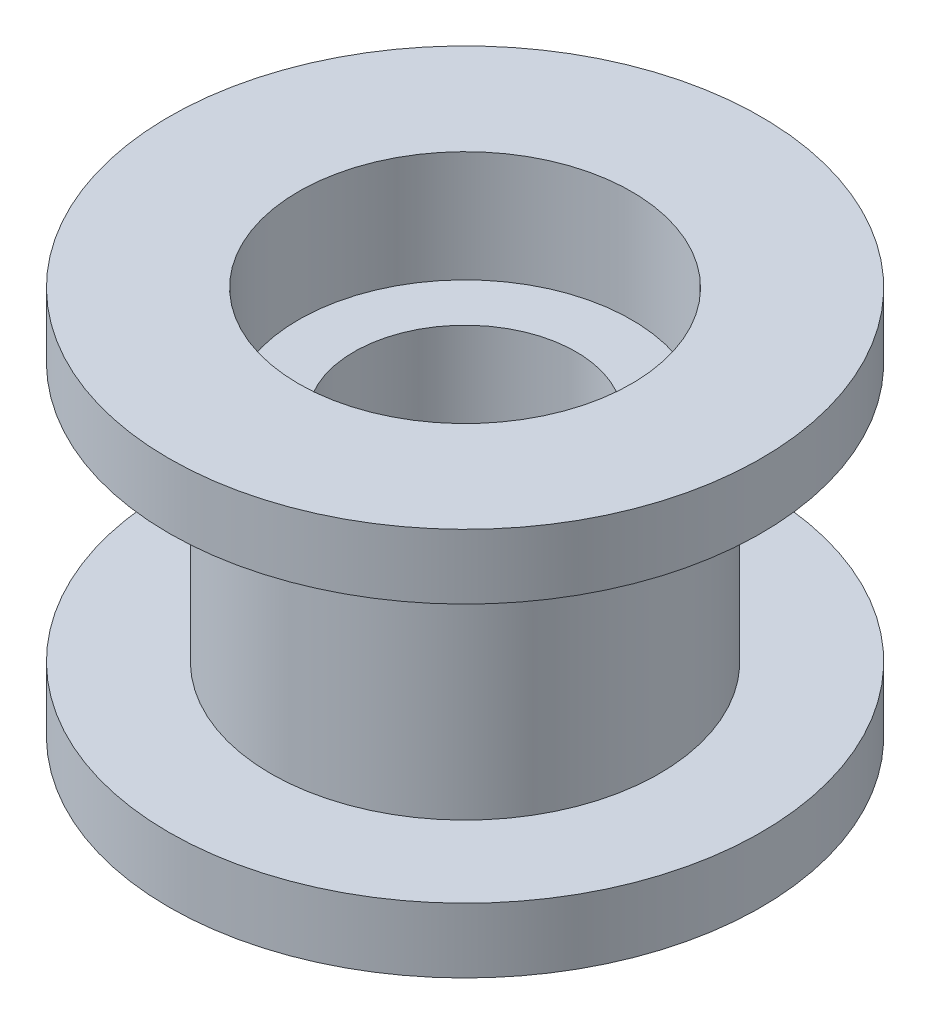
ISO-10303-21;
HEADER;
FILE_DESCRIPTION(('STEP AP214'),'2;1');
FILE_NAME('part.step','',(''),(''),'','','');
FILE_SCHEMA(('AUTOMOTIVE_DESIGN { 1 0 10303 214 1 1 1 1 }'));
ENDSEC;
DATA;
#1=APPLICATION_CONTEXT('core data for automotive mechanical design processes');
#2=APPLICATION_PROTOCOL_DEFINITION('international standard','automotive_design',2000,#1);
#3=PRODUCT_CONTEXT('',#1,'mechanical');
#4=PRODUCT('Part','Part','',(#3));
#5=PRODUCT_RELATED_PRODUCT_CATEGORY('part','',(#4));
#6=PRODUCT_DEFINITION_FORMATION('','',#4);
#7=PRODUCT_DEFINITION_CONTEXT('part definition',#1,'design');
#8=PRODUCT_DEFINITION('design','',#6,#7);
#9=PRODUCT_DEFINITION_SHAPE('','',#8);
#10=(LENGTH_UNIT() NAMED_UNIT(*) SI_UNIT(.MILLI.,.METRE.));
#11=(NAMED_UNIT(*) PLANE_ANGLE_UNIT() SI_UNIT($,.RADIAN.));
#12=(NAMED_UNIT(*) SI_UNIT($,.STERADIAN.) SOLID_ANGLE_UNIT());
#13=UNCERTAINTY_MEASURE_WITH_UNIT(LENGTH_MEASURE(1.E-05),#10,'distance_accuracy_value','');
#14=(GEOMETRIC_REPRESENTATION_CONTEXT(3) GLOBAL_UNCERTAINTY_ASSIGNED_CONTEXT((#13)) GLOBAL_UNIT_ASSIGNED_CONTEXT((#10,
#11,#12)) REPRESENTATION_CONTEXT('',''));
#15=CARTESIAN_POINT('',(0.,0.,0.));
#16=DIRECTION('',(0.,0.,1.));
#17=DIRECTION('',(1.,0.,0.));
#18=AXIS2_PLACEMENT_3D('',#15,#16,#17);
#19=CARTESIAN_POINT('',(0.,0.,0.));
#20=DIRECTION('',(0.,1.,0.));
#21=DIRECTION('',(0.,0.,1.));
#22=AXIS2_PLACEMENT_3D('',#19,#20,#21);
#23=CYLINDRICAL_SURFACE('',#22,4.5);
#24=CARTESIAN_POINT('',(0.,0.,0.));
#25=DIRECTION('',(0.,1.,0.));
#26=DIRECTION('',(0.,0.,1.));
#27=AXIS2_PLACEMENT_3D('',#24,#25,#26);
#28=CIRCLE('',#27,4.5);
#29=CARTESIAN_POINT('',(0.,0.,4.5));
#30=VERTEX_POINT('',#29);
#31=EDGE_CURVE('E10',#30,#30,#28,.T.);
#32=ORIENTED_EDGE('',*,*,#31,.T.);
#33=EDGE_LOOP('',(#32));
#34=FACE_BOUND('',#33,.T.);
#35=CARTESIAN_POINT('',(0.,-3.,0.));
#36=DIRECTION('',(0.,1.,0.));
#37=DIRECTION('',(0.,0.,1.));
#38=AXIS2_PLACEMENT_3D('',#35,#36,#37);
#39=CIRCLE('',#38,4.5);
#40=CARTESIAN_POINT('',(0.,-3.,4.5));
#41=VERTEX_POINT('',#40);
#42=EDGE_CURVE('E71',#41,#41,#39,.T.);
#43=ORIENTED_EDGE('',*,*,#42,.F.);
#44=EDGE_LOOP('',(#43));
#45=FACE_BOUND('',#44,.T.);
#46=ADVANCED_FACE('F31',(#34,#45),#23,.F.);
#47=CARTESIAN_POINT('',(-4.5,0.,0.));
#48=DIRECTION('',(0.,1.,0.));
#49=DIRECTION('',(0.,0.,1.));
#50=AXIS2_PLACEMENT_3D('',#47,#48,#49);
#51=PLANE('',#50);
#52=CARTESIAN_POINT('',(0.,0.,0.));
#53=DIRECTION('',(0.,1.,0.));
#54=DIRECTION('',(0.,0.,1.));
#55=AXIS2_PLACEMENT_3D('',#52,#53,#54);
#56=CIRCLE('',#55,8.);
#57=CARTESIAN_POINT('',(0.,0.,8.));
#58=VERTEX_POINT('',#57);
#59=EDGE_CURVE('E37',#58,#58,#56,.T.);
#60=ORIENTED_EDGE('',*,*,#59,.T.);
#61=EDGE_LOOP('',(#60));
#62=FACE_BOUND('',#61,.T.);
#63=ORIENTED_EDGE('',*,*,#31,.F.);
#64=EDGE_LOOP('',(#63));
#65=FACE_BOUND('',#64,.T.);
#66=ADVANCED_FACE('F79',(#62,#65),#51,.T.);
#67=CARTESIAN_POINT('',(0.,0.,0.));
#68=DIRECTION('',(0.,1.,0.));
#69=DIRECTION('',(0.,0.,1.));
#70=AXIS2_PLACEMENT_3D('',#67,#68,#69);
#71=CYLINDRICAL_SURFACE('',#70,8.);
#72=CARTESIAN_POINT('',(0.,-1.75,0.));
#73=DIRECTION('',(0.,1.,0.));
#74=DIRECTION('',(0.,0.,1.));
#75=AXIS2_PLACEMENT_3D('',#72,#73,#74);
#76=CIRCLE('',#75,8.);
#77=CARTESIAN_POINT('',(0.,-1.75,8.));
#78=VERTEX_POINT('',#77);
#79=EDGE_CURVE('E41',#78,#78,#76,.T.);
#80=ORIENTED_EDGE('',*,*,#79,.T.);
#81=EDGE_LOOP('',(#80));
#82=FACE_BOUND('',#81,.T.);
#83=ORIENTED_EDGE('',*,*,#59,.F.);
#84=EDGE_LOOP('',(#83));
#85=FACE_BOUND('',#84,.T.);
#86=ADVANCED_FACE('F83',(#82,#85),#71,.T.);
#87=CARTESIAN_POINT('',(-8.,-1.75,0.));
#88=DIRECTION('',(0.,-1.,0.));
#89=DIRECTION('',(0.,0.,-1.));
#90=AXIS2_PLACEMENT_3D('',#87,#88,#89);
#91=PLANE('',#90);
#92=CARTESIAN_POINT('',(0.,-1.75,0.));
#93=DIRECTION('',(0.,1.,0.));
#94=DIRECTION('',(0.,0.,1.));
#95=AXIS2_PLACEMENT_3D('',#92,#93,#94);
#96=CIRCLE('',#95,5.25);
#97=CARTESIAN_POINT('',(0.,-1.75,5.25));
#98=VERTEX_POINT('',#97);
#99=EDGE_CURVE('E45',#98,#98,#96,.T.);
#100=ORIENTED_EDGE('',*,*,#99,.T.);
#101=EDGE_LOOP('',(#100));
#102=FACE_BOUND('',#101,.T.);
#103=ORIENTED_EDGE('',*,*,#79,.F.);
#104=EDGE_LOOP('',(#103));
#105=FACE_BOUND('',#104,.T.);
#106=ADVANCED_FACE('F87',(#102,#105),#91,.T.);
#107=CARTESIAN_POINT('',(0.,0.,0.));
#108=DIRECTION('',(0.,1.,0.));
#109=DIRECTION('',(0.,0.,1.));
#110=AXIS2_PLACEMENT_3D('',#107,#108,#109);
#111=CYLINDRICAL_SURFACE('',#110,5.25);
#112=CARTESIAN_POINT('',(0.,-8.75,0.));
#113=DIRECTION('',(0.,1.,0.));
#114=DIRECTION('',(0.,0.,1.));
#115=AXIS2_PLACEMENT_3D('',#112,#113,#114);
#116=CIRCLE('',#115,5.25);
#117=CARTESIAN_POINT('',(0.,-8.75,5.25));
#118=VERTEX_POINT('',#117);
#119=EDGE_CURVE('E50',#118,#118,#116,.T.);
#120=ORIENTED_EDGE('',*,*,#119,.T.);
#121=EDGE_LOOP('',(#120));
#122=FACE_BOUND('',#121,.T.);
#123=ORIENTED_EDGE('',*,*,#99,.F.);
#124=EDGE_LOOP('',(#123));
#125=FACE_BOUND('',#124,.T.);
#126=ADVANCED_FACE('F94',(#122,#125),#111,.T.);
#127=CARTESIAN_POINT('',(-8.,-8.75,0.));
#128=DIRECTION('',(0.,1.,0.));
#129=DIRECTION('',(0.,0.,1.));
#130=AXIS2_PLACEMENT_3D('',#127,#128,#129);
#131=PLANE('',#130);
#132=CARTESIAN_POINT('',(0.,-8.75,0.));
#133=DIRECTION('',(0.,1.,0.));
#134=DIRECTION('',(0.,0.,1.));
#135=AXIS2_PLACEMENT_3D('',#132,#133,#134);
#136=CIRCLE('',#135,8.);
#137=CARTESIAN_POINT('',(0.,-8.75,8.));
#138=VERTEX_POINT('',#137);
#139=EDGE_CURVE('E53',#138,#138,#136,.T.);
#140=ORIENTED_EDGE('',*,*,#139,.T.);
#141=EDGE_LOOP('',(#140));
#142=FACE_BOUND('',#141,.T.);
#143=ORIENTED_EDGE('',*,*,#119,.F.);
#144=EDGE_LOOP('',(#143));
#145=FACE_BOUND('',#144,.T.);
#146=ADVANCED_FACE('F98',(#142,#145),#131,.T.);
#147=CARTESIAN_POINT('',(0.,0.,0.));
#148=DIRECTION('',(0.,1.,0.));
#149=DIRECTION('',(0.,0.,1.));
#150=AXIS2_PLACEMENT_3D('',#147,#148,#149);
#151=CYLINDRICAL_SURFACE('',#150,8.);
#152=CARTESIAN_POINT('',(0.,-10.5,0.));
#153=DIRECTION('',(0.,1.,0.));
#154=DIRECTION('',(0.,0.,1.));
#155=AXIS2_PLACEMENT_3D('',#152,#153,#154);
#156=CIRCLE('',#155,7.99999999999999);
#157=CARTESIAN_POINT('',(0.,-10.5,7.99999999999999));
#158=VERTEX_POINT('',#157);
#159=EDGE_CURVE('E56',#158,#158,#156,.T.);
#160=ORIENTED_EDGE('',*,*,#159,.T.);
#161=EDGE_LOOP('',(#160));
#162=FACE_BOUND('',#161,.T.);
#163=ORIENTED_EDGE('',*,*,#139,.F.);
#164=EDGE_LOOP('',(#163));
#165=FACE_BOUND('',#164,.T.);
#166=ADVANCED_FACE('F102',(#162,#165),#151,.T.);
#167=CARTESIAN_POINT('',(-4.5,-10.5,0.));
#168=DIRECTION('',(0.,-1.,0.));
#169=DIRECTION('',(0.,0.,-1.));
#170=AXIS2_PLACEMENT_3D('',#167,#168,#169);
#171=PLANE('',#170);
#172=CARTESIAN_POINT('',(0.,-10.5,0.));
#173=DIRECTION('',(0.,1.,0.));
#174=DIRECTION('',(0.,0.,1.));
#175=AXIS2_PLACEMENT_3D('',#172,#173,#174);
#176=CIRCLE('',#175,4.5);
#177=CARTESIAN_POINT('',(0.,-10.5,4.5));
#178=VERTEX_POINT('',#177);
#179=EDGE_CURVE('E59',#178,#178,#176,.T.);
#180=ORIENTED_EDGE('',*,*,#179,.T.);
#181=EDGE_LOOP('',(#180));
#182=FACE_BOUND('',#181,.T.);
#183=ORIENTED_EDGE('',*,*,#159,.F.);
#184=EDGE_LOOP('',(#183));
#185=FACE_BOUND('',#184,.T.);
#186=ADVANCED_FACE('F106',(#182,#185),#171,.T.);
#187=CARTESIAN_POINT('',(0.,0.,0.));
#188=DIRECTION('',(0.,1.,0.));
#189=DIRECTION('',(0.,0.,1.));
#190=AXIS2_PLACEMENT_3D('',#187,#188,#189);
#191=CYLINDRICAL_SURFACE('',#190,4.5);
#192=CARTESIAN_POINT('',(0.,-7.5,0.));
#193=DIRECTION('',(0.,1.,0.));
#194=DIRECTION('',(0.,0.,1.));
#195=AXIS2_PLACEMENT_3D('',#192,#193,#194);
#196=CIRCLE('',#195,4.5);
#197=CARTESIAN_POINT('',(0.,-7.5,4.5));
#198=VERTEX_POINT('',#197);
#199=EDGE_CURVE('E62',#198,#198,#196,.T.);
#200=ORIENTED_EDGE('',*,*,#199,.T.);
#201=EDGE_LOOP('',(#200));
#202=FACE_BOUND('',#201,.T.);
#203=ORIENTED_EDGE('',*,*,#179,.F.);
#204=EDGE_LOOP('',(#203));
#205=FACE_BOUND('',#204,.T.);
#206=ADVANCED_FACE('F110',(#202,#205),#191,.F.);
#207=CARTESIAN_POINT('',(-3.,-7.5,0.));
#208=DIRECTION('',(0.,-1.,0.));
#209=DIRECTION('',(0.,0.,-1.));
#210=AXIS2_PLACEMENT_3D('',#207,#208,#209);
#211=PLANE('',#210);
#212=CARTESIAN_POINT('',(0.,-7.5,0.));
#213=DIRECTION('',(0.,1.,0.));
#214=DIRECTION('',(0.,0.,1.));
#215=AXIS2_PLACEMENT_3D('',#212,#213,#214);
#216=CIRCLE('',#215,3.);
#217=CARTESIAN_POINT('',(0.,-7.5,3.));
#218=VERTEX_POINT('',#217);
#219=EDGE_CURVE('E65',#218,#218,#216,.T.);
#220=ORIENTED_EDGE('',*,*,#219,.T.);
#221=EDGE_LOOP('',(#220));
#222=FACE_BOUND('',#221,.T.);
#223=ORIENTED_EDGE('',*,*,#199,.F.);
#224=EDGE_LOOP('',(#223));
#225=FACE_BOUND('',#224,.T.);
#226=ADVANCED_FACE('F114',(#222,#225),#211,.T.);
#227=CARTESIAN_POINT('',(0.,0.,0.));
#228=DIRECTION('',(0.,1.,0.));
#229=DIRECTION('',(0.,0.,1.));
#230=AXIS2_PLACEMENT_3D('',#227,#228,#229);
#231=CYLINDRICAL_SURFACE('',#230,3.);
#232=CARTESIAN_POINT('',(0.,-3.,0.));
#233=DIRECTION('',(0.,1.,0.));
#234=DIRECTION('',(0.,0.,1.));
#235=AXIS2_PLACEMENT_3D('',#232,#233,#234);
#236=CIRCLE('',#235,3.);
#237=CARTESIAN_POINT('',(0.,-3.,3.));
#238=VERTEX_POINT('',#237);
#239=EDGE_CURVE('E68',#238,#238,#236,.T.);
#240=ORIENTED_EDGE('',*,*,#239,.T.);
#241=EDGE_LOOP('',(#240));
#242=FACE_BOUND('',#241,.T.);
#243=ORIENTED_EDGE('',*,*,#219,.F.);
#244=EDGE_LOOP('',(#243));
#245=FACE_BOUND('',#244,.T.);
#246=ADVANCED_FACE('F118',(#242,#245),#231,.F.);
#247=CARTESIAN_POINT('',(-3.,-3.,0.));
#248=DIRECTION('',(0.,1.,0.));
#249=DIRECTION('',(0.,0.,1.));
#250=AXIS2_PLACEMENT_3D('',#247,#248,#249);
#251=PLANE('',#250);
#252=ORIENTED_EDGE('',*,*,#42,.T.);
#253=EDGE_LOOP('',(#252));
#254=FACE_BOUND('',#253,.T.);
#255=ORIENTED_EDGE('',*,*,#239,.F.);
#256=EDGE_LOOP('',(#255));
#257=FACE_BOUND('',#256,.T.);
#258=ADVANCED_FACE('F75',(#254,#257),#251,.T.);
#259=CLOSED_SHELL('',(#46,#66,#86,#106,#126,#146,#166,#186,#206,#226,#246,#258));
#260=MANIFOLD_SOLID_BREP('B2',#259);
#261=ADVANCED_BREP_SHAPE_REPRESENTATION('',(#18,#260),#14);
#262=SHAPE_DEFINITION_REPRESENTATION(#9,#261);
ENDSEC;
END-ISO-10303-21;
